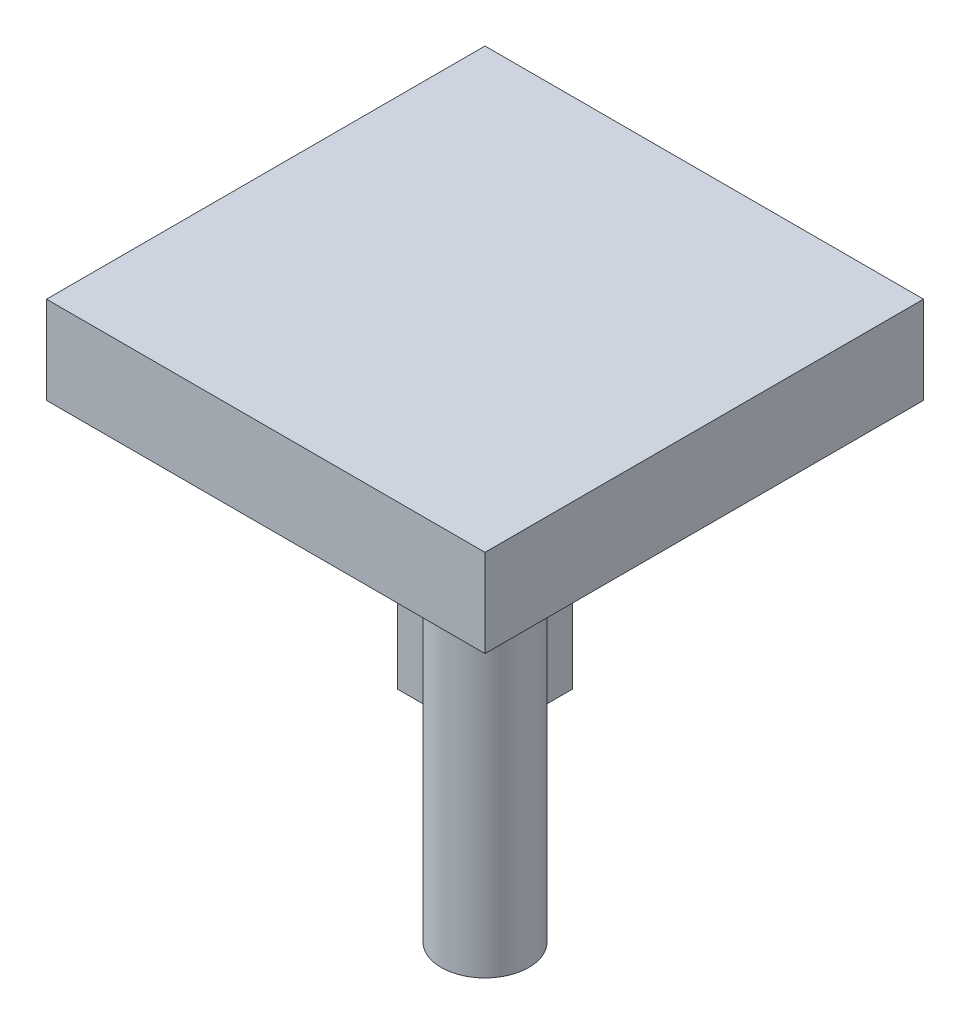
ISO-10303-21;
HEADER;
FILE_DESCRIPTION(('STEP AP214'),'2;1');
FILE_NAME('part.step','',(''),(''),'','','');
FILE_SCHEMA(('AUTOMOTIVE_DESIGN { 1 0 10303 214 1 1 1 1 }'));
ENDSEC;
DATA;
#1=APPLICATION_CONTEXT('core data for automotive mechanical design processes');
#2=APPLICATION_PROTOCOL_DEFINITION('international standard','automotive_design',2000,#1);
#3=PRODUCT_CONTEXT('',#1,'mechanical');
#4=PRODUCT('Part','Part','',(#3));
#5=PRODUCT_RELATED_PRODUCT_CATEGORY('part','',(#4));
#6=PRODUCT_DEFINITION_FORMATION('','',#4);
#7=PRODUCT_DEFINITION_CONTEXT('part definition',#1,'design');
#8=PRODUCT_DEFINITION('design','',#6,#7);
#9=PRODUCT_DEFINITION_SHAPE('','',#8);
#10=(LENGTH_UNIT() NAMED_UNIT(*) SI_UNIT(.MILLI.,.METRE.));
#11=(NAMED_UNIT(*) PLANE_ANGLE_UNIT() SI_UNIT($,.RADIAN.));
#12=(NAMED_UNIT(*) SI_UNIT($,.STERADIAN.) SOLID_ANGLE_UNIT());
#13=UNCERTAINTY_MEASURE_WITH_UNIT(LENGTH_MEASURE(1.E-05),#10,'distance_accuracy_value','');
#14=(GEOMETRIC_REPRESENTATION_CONTEXT(3) GLOBAL_UNCERTAINTY_ASSIGNED_CONTEXT((#13)) GLOBAL_UNIT_ASSIGNED_CONTEXT((#10,
#11,#12)) REPRESENTATION_CONTEXT('',''));
#15=CARTESIAN_POINT('',(0.,0.,0.));
#16=DIRECTION('',(0.,0.,1.));
#17=DIRECTION('',(1.,0.,0.));
#18=AXIS2_PLACEMENT_3D('',#15,#16,#17);
#19=CARTESIAN_POINT('',(-15.,-2.,-35.));
#20=DIRECTION('',(1.,0.,0.));
#21=DIRECTION('',(0.,0.,-1.));
#22=AXIS2_PLACEMENT_3D('',#19,#20,#21);
#23=PLANE('',#22);
#24=DIRECTION('',(0.,0.,1.));
#25=VECTOR('',#24,1.);
#26=CARTESIAN_POINT('',(-15.,-82.,-35.));
#27=LINE('',#26,#25);
#28=CARTESIAN_POINT('',(-15.,-82.,-35.));
#29=VERTEX_POINT('',#28);
#30=CARTESIAN_POINT('',(-15.,-82.,-15.));
#31=VERTEX_POINT('',#30);
#32=EDGE_CURVE('E70',#29,#31,#27,.T.);
#33=ORIENTED_EDGE('',*,*,#32,.F.);
#34=DIRECTION('',(0.,-1.,0.));
#35=VECTOR('',#34,1.);
#36=CARTESIAN_POINT('',(-15.,-2.,-35.));
#37=LINE('',#36,#35);
#38=CARTESIAN_POINT('',(-15.,-2.,-35.));
#39=VERTEX_POINT('',#38);
#40=EDGE_CURVE('E78',#39,#29,#37,.T.);
#41=ORIENTED_EDGE('',*,*,#40,.F.);
#42=DIRECTION('',(0.,0.,1.));
#43=VECTOR('',#42,1.);
#44=CARTESIAN_POINT('',(-15.,-2.,-35.));
#45=LINE('',#44,#43);
#46=CARTESIAN_POINT('',(-15.,-2.,-15.));
#47=VERTEX_POINT('',#46);
#48=EDGE_CURVE('E13',#39,#47,#45,.T.);
#49=ORIENTED_EDGE('',*,*,#48,.T.);
#50=DIRECTION('',(0.,-1.,0.));
#51=VECTOR('',#50,1.);
#52=CARTESIAN_POINT('',(-15.,-2.,-15.));
#53=LINE('',#52,#51);
#54=EDGE_CURVE('E107',#47,#31,#53,.T.);
#55=ORIENTED_EDGE('',*,*,#54,.T.);
#56=EDGE_LOOP('',(#33,#41,#49,#55));
#57=FACE_BOUND('',#56,.T.);
#58=ADVANCED_FACE('F62',(#57),#23,.T.);
#59=CARTESIAN_POINT('',(-35.,-2.,-15.));
#60=DIRECTION('',(0.,0.,1.));
#61=DIRECTION('',(1.,0.,0.));
#62=AXIS2_PLACEMENT_3D('',#59,#60,#61);
#63=PLANE('',#62);
#64=DIRECTION('',(-1.,0.,0.));
#65=VECTOR('',#64,1.);
#66=CARTESIAN_POINT('',(-35.,-82.,-15.));
#67=LINE('',#66,#65);
#68=CARTESIAN_POINT('',(-35.,-82.,-15.));
#69=VERTEX_POINT('',#68);
#70=EDGE_CURVE('E112',#31,#69,#67,.T.);
#71=ORIENTED_EDGE('',*,*,#70,.F.);
#72=ORIENTED_EDGE('',*,*,#54,.F.);
#73=DIRECTION('',(-1.,0.,0.));
#74=VECTOR('',#73,1.);
#75=CARTESIAN_POINT('',(-35.,-2.,-15.));
#76=LINE('',#75,#74);
#77=CARTESIAN_POINT('',(-35.,-2.,-15.));
#78=VERTEX_POINT('',#77);
#79=EDGE_CURVE('E110',#47,#78,#76,.T.);
#80=ORIENTED_EDGE('',*,*,#79,.T.);
#81=DIRECTION('',(0.,-1.,0.));
#82=VECTOR('',#81,1.);
#83=CARTESIAN_POINT('',(-35.,-2.,-15.));
#84=LINE('',#83,#82);
#85=EDGE_CURVE('E64',#78,#69,#84,.T.);
#86=ORIENTED_EDGE('',*,*,#85,.T.);
#87=EDGE_LOOP('',(#71,#72,#80,#86));
#88=FACE_BOUND('',#87,.T.);
#89=ADVANCED_FACE('F109',(#88),#63,.T.);
#90=CARTESIAN_POINT('',(-35.,-2.,-35.));
#91=DIRECTION('',(-1.,0.,0.));
#92=DIRECTION('',(0.,0.,1.));
#93=AXIS2_PLACEMENT_3D('',#90,#91,#92);
#94=PLANE('',#93);
#95=DIRECTION('',(0.,0.,-1.));
#96=VECTOR('',#95,1.);
#97=CARTESIAN_POINT('',(-35.,-82.,-35.));
#98=LINE('',#97,#96);
#99=CARTESIAN_POINT('',(-35.,-82.,-35.));
#100=VERTEX_POINT('',#99);
#101=EDGE_CURVE('E133',#69,#100,#98,.T.);
#102=ORIENTED_EDGE('',*,*,#101,.F.);
#103=ORIENTED_EDGE('',*,*,#85,.F.);
#104=DIRECTION('',(0.,0.,-1.));
#105=VECTOR('',#104,1.);
#106=CARTESIAN_POINT('',(-35.,-2.,-35.));
#107=LINE('',#106,#105);
#108=CARTESIAN_POINT('',(-35.,-2.,-35.));
#109=VERTEX_POINT('',#108);
#110=EDGE_CURVE('E138',#78,#109,#107,.T.);
#111=ORIENTED_EDGE('',*,*,#110,.T.);
#112=DIRECTION('',(0.,-1.,0.));
#113=VECTOR('',#112,1.);
#114=CARTESIAN_POINT('',(-35.,-2.,-35.));
#115=LINE('',#114,#113);
#116=EDGE_CURVE('E95',#109,#100,#115,.T.);
#117=ORIENTED_EDGE('',*,*,#116,.T.);
#118=EDGE_LOOP('',(#102,#103,#111,#117));
#119=FACE_BOUND('',#118,.T.);
#120=ADVANCED_FACE('F120',(#119),#94,.T.);
#121=CARTESIAN_POINT('',(-35.,-2.,-35.));
#122=DIRECTION('',(0.,0.,-1.));
#123=DIRECTION('',(-1.,0.,0.));
#124=AXIS2_PLACEMENT_3D('',#121,#122,#123);
#125=PLANE('',#124);
#126=DIRECTION('',(1.,0.,0.));
#127=VECTOR('',#126,1.);
#128=CARTESIAN_POINT('',(-35.,-82.,-35.));
#129=LINE('',#128,#127);
#130=EDGE_CURVE('E128',#100,#29,#129,.T.);
#131=ORIENTED_EDGE('',*,*,#130,.F.);
#132=ORIENTED_EDGE('',*,*,#116,.F.);
#133=DIRECTION('',(1.,0.,0.));
#134=VECTOR('',#133,1.);
#135=CARTESIAN_POINT('',(-35.,-2.,-35.));
#136=LINE('',#135,#134);
#137=EDGE_CURVE('E139',#109,#39,#136,.T.);
#138=ORIENTED_EDGE('',*,*,#137,.T.);
#139=ORIENTED_EDGE('',*,*,#40,.T.);
#140=EDGE_LOOP('',(#131,#132,#138,#139));
#141=FACE_BOUND('',#140,.T.);
#142=ADVANCED_FACE('F123',(#141),#125,.T.);
#143=OPEN_SHELL('',(#58,#89,#120,#142));
#144=SHELL_BASED_SURFACE_MODEL('B2',(#143));
#145=CARTESIAN_POINT('',(25.,-2.,25.));
#146=DIRECTION('',(0.,-1.,0.));
#147=DIRECTION('',(0.,0.,-1.));
#148=AXIS2_PLACEMENT_3D('',#145,#146,#147);
#149=CYLINDRICAL_SURFACE('',#148,10.);
#150=CARTESIAN_POINT('',(25.,-2.,25.));
#151=DIRECTION('',(0.,-1.,0.));
#152=DIRECTION('',(0.,0.,-1.));
#153=AXIS2_PLACEMENT_3D('',#150,#151,#152);
#154=CIRCLE('',#153,10.);
#155=CARTESIAN_POINT('',(25.,-2.,15.));
#156=VERTEX_POINT('',#155);
#157=EDGE_CURVE('E212',#156,#156,#154,.T.);
#158=ORIENTED_EDGE('',*,*,#157,.T.);
#159=EDGE_LOOP('',(#158));
#160=FACE_BOUND('',#159,.T.);
#161=CARTESIAN_POINT('',(25.,-82.,25.));
#162=DIRECTION('',(0.,-1.,0.));
#163=DIRECTION('',(0.,0.,-1.));
#164=AXIS2_PLACEMENT_3D('',#161,#162,#163);
#165=CIRCLE('',#164,10.);
#166=CARTESIAN_POINT('',(25.,-82.,15.));
#167=VERTEX_POINT('',#166);
#168=EDGE_CURVE('E61',#167,#167,#165,.T.);
#169=ORIENTED_EDGE('',*,*,#168,.F.);
#170=EDGE_LOOP('',(#169));
#171=FACE_BOUND('',#170,.T.);
#172=ADVANCED_FACE('F207',(#160,#171),#149,.T.);
#173=OPEN_SHELL('',(#172));
#174=SHELL_BASED_SURFACE_MODEL('B7',(#173));
#175=CARTESIAN_POINT('',(-50.,20.,-50.));
#176=DIRECTION('',(1.,0.,0.));
#177=DIRECTION('',(0.,0.,-1.));
#178=AXIS2_PLACEMENT_3D('',#175,#176,#177);
#179=PLANE('',#178);
#180=DIRECTION('',(0.,0.,1.));
#181=VECTOR('',#180,1.);
#182=CARTESIAN_POINT('',(-50.,0.,-50.));
#183=LINE('',#182,#181);
#184=CARTESIAN_POINT('',(-50.,0.,-50.));
#185=VERTEX_POINT('',#184);
#186=CARTESIAN_POINT('',(-50.,0.,50.));
#187=VERTEX_POINT('',#186);
#188=EDGE_CURVE('E334',#185,#187,#183,.T.);
#189=ORIENTED_EDGE('',*,*,#188,.T.);
#190=DIRECTION('',(0.,-1.,0.));
#191=VECTOR('',#190,1.);
#192=CARTESIAN_POINT('',(-50.,20.,50.));
#193=LINE('',#192,#191);
#194=CARTESIAN_POINT('',(-50.,20.,50.));
#195=VERTEX_POINT('',#194);
#196=EDGE_CURVE('E205',#195,#187,#193,.T.);
#197=ORIENTED_EDGE('',*,*,#196,.F.);
#198=DIRECTION('',(0.,0.,1.));
#199=VECTOR('',#198,1.);
#200=CARTESIAN_POINT('',(-50.,20.,-50.));
#201=LINE('',#200,#199);
#202=CARTESIAN_POINT('',(-50.,20.,-50.));
#203=VERTEX_POINT('',#202);
#204=EDGE_CURVE('E289',#203,#195,#201,.T.);
#205=ORIENTED_EDGE('',*,*,#204,.F.);
#206=DIRECTION('',(0.,-1.,0.));
#207=VECTOR('',#206,1.);
#208=CARTESIAN_POINT('',(-50.,20.,-50.));
#209=LINE('',#208,#207);
#210=EDGE_CURVE('E301',#203,#185,#209,.T.);
#211=ORIENTED_EDGE('',*,*,#210,.T.);
#212=EDGE_LOOP('',(#189,#197,#205,#211));
#213=FACE_BOUND('',#212,.T.);
#214=ADVANCED_FACE('F236',(#213),#179,.F.);
#215=CARTESIAN_POINT('',(50.,20.,50.));
#216=DIRECTION('',(0.,0.,-1.));
#217=DIRECTION('',(-1.,0.,0.));
#218=AXIS2_PLACEMENT_3D('',#215,#216,#217);
#219=PLANE('',#218);
#220=DIRECTION('',(1.,0.,0.));
#221=VECTOR('',#220,1.);
#222=CARTESIAN_POINT('',(50.,0.,50.));
#223=LINE('',#222,#221);
#224=CARTESIAN_POINT('',(50.,0.,50.));
#225=VERTEX_POINT('',#224);
#226=EDGE_CURVE('E294',#187,#225,#223,.T.);
#227=ORIENTED_EDGE('',*,*,#226,.T.);
#228=DIRECTION('',(0.,-1.,0.));
#229=VECTOR('',#228,1.);
#230=CARTESIAN_POINT('',(50.,20.,50.));
#231=LINE('',#230,#229);
#232=CARTESIAN_POINT('',(50.,20.,50.));
#233=VERTEX_POINT('',#232);
#234=EDGE_CURVE('E246',#233,#225,#231,.T.);
#235=ORIENTED_EDGE('',*,*,#234,.F.);
#236=DIRECTION('',(1.,0.,0.));
#237=VECTOR('',#236,1.);
#238=CARTESIAN_POINT('',(50.,20.,50.));
#239=LINE('',#238,#237);
#240=EDGE_CURVE('E284',#195,#233,#239,.T.);
#241=ORIENTED_EDGE('',*,*,#240,.F.);
#242=ORIENTED_EDGE('',*,*,#196,.T.);
#243=EDGE_LOOP('',(#227,#235,#241,#242));
#244=FACE_BOUND('',#243,.T.);
#245=ADVANCED_FACE('F293',(#244),#219,.F.);
#246=CARTESIAN_POINT('',(50.,20.,-50.));
#247=DIRECTION('',(-1.,0.,0.));
#248=DIRECTION('',(0.,0.,1.));
#249=AXIS2_PLACEMENT_3D('',#246,#247,#248);
#250=PLANE('',#249);
#251=DIRECTION('',(0.,0.,-1.));
#252=VECTOR('',#251,1.);
#253=CARTESIAN_POINT('',(50.,0.,-50.));
#254=LINE('',#253,#252);
#255=CARTESIAN_POINT('',(50.,0.,-50.));
#256=VERTEX_POINT('',#255);
#257=EDGE_CURVE('E271',#225,#256,#254,.T.);
#258=ORIENTED_EDGE('',*,*,#257,.T.);
#259=DIRECTION('',(0.,-1.,0.));
#260=VECTOR('',#259,1.);
#261=CARTESIAN_POINT('',(50.,20.,-50.));
#262=LINE('',#261,#260);
#263=CARTESIAN_POINT('',(50.,20.,-50.));
#264=VERTEX_POINT('',#263);
#265=EDGE_CURVE('E296',#264,#256,#262,.T.);
#266=ORIENTED_EDGE('',*,*,#265,.F.);
#267=DIRECTION('',(0.,0.,-1.));
#268=VECTOR('',#267,1.);
#269=CARTESIAN_POINT('',(50.,20.,-50.));
#270=LINE('',#269,#268);
#271=EDGE_CURVE('E287',#233,#264,#270,.T.);
#272=ORIENTED_EDGE('',*,*,#271,.F.);
#273=ORIENTED_EDGE('',*,*,#234,.T.);
#274=EDGE_LOOP('',(#258,#266,#272,#273));
#275=FACE_BOUND('',#274,.T.);
#276=ADVANCED_FACE('F297',(#275),#250,.F.);
#277=CARTESIAN_POINT('',(50.,20.,-50.));
#278=DIRECTION('',(0.,0.,1.));
#279=DIRECTION('',(1.,0.,0.));
#280=AXIS2_PLACEMENT_3D('',#277,#278,#279);
#281=PLANE('',#280);
#282=DIRECTION('',(-1.,0.,0.));
#283=VECTOR('',#282,1.);
#284=CARTESIAN_POINT('',(50.,0.,-50.));
#285=LINE('',#284,#283);
#286=EDGE_CURVE('E277',#256,#185,#285,.T.);
#287=ORIENTED_EDGE('',*,*,#286,.T.);
#288=ORIENTED_EDGE('',*,*,#210,.F.);
#289=DIRECTION('',(-1.,0.,0.));
#290=VECTOR('',#289,1.);
#291=CARTESIAN_POINT('',(50.,20.,-50.));
#292=LINE('',#291,#290);
#293=EDGE_CURVE('E254',#264,#203,#292,.T.);
#294=ORIENTED_EDGE('',*,*,#293,.F.);
#295=ORIENTED_EDGE('',*,*,#265,.T.);
#296=EDGE_LOOP('',(#287,#288,#294,#295));
#297=FACE_BOUND('',#296,.T.);
#298=ADVANCED_FACE('F346',(#297),#281,.F.);
#299=CARTESIAN_POINT('',(0.,20.,0.));
#300=DIRECTION('',(0.,-1.,0.));
#301=DIRECTION('',(0.,0.,-1.));
#302=AXIS2_PLACEMENT_3D('',#299,#300,#301);
#303=PLANE('',#302);
#304=ORIENTED_EDGE('',*,*,#204,.T.);
#305=ORIENTED_EDGE('',*,*,#240,.T.);
#306=ORIENTED_EDGE('',*,*,#271,.T.);
#307=ORIENTED_EDGE('',*,*,#293,.T.);
#308=EDGE_LOOP('',(#304,#305,#306,#307));
#309=FACE_BOUND('',#308,.T.);
#310=ADVANCED_FACE('F285',(#309),#303,.F.);
#311=CARTESIAN_POINT('',(0.,0.,0.));
#312=DIRECTION('',(0.,-1.,0.));
#313=DIRECTION('',(0.,0.,-1.));
#314=AXIS2_PLACEMENT_3D('',#311,#312,#313);
#315=PLANE('',#314);
#316=ORIENTED_EDGE('',*,*,#188,.F.);
#317=ORIENTED_EDGE('',*,*,#286,.F.);
#318=ORIENTED_EDGE('',*,*,#257,.F.);
#319=ORIENTED_EDGE('',*,*,#226,.F.);
#320=EDGE_LOOP('',(#316,#317,#318,#319));
#321=FACE_BOUND('',#320,.T.);
#322=ADVANCED_FACE('F341',(#321),#315,.T.);
#323=CLOSED_SHELL('',(#214,#245,#276,#298,#310,#322));
#324=MANIFOLD_SOLID_BREP('B56',#323);
#325=ADVANCED_BREP_SHAPE_REPRESENTATION('',(#18,#324),#14);
#326=MANIFOLD_SURFACE_SHAPE_REPRESENTATION('',(#18,#144,#174),#14);
#327=SHAPE_REPRESENTATION('',(#18),#14);
#328=SHAPE_DEFINITION_REPRESENTATION(#9,#327);
#329=SHAPE_REPRESENTATION_RELATIONSHIP('','',#327,#325);
#330=SHAPE_REPRESENTATION_RELATIONSHIP('','',#327,#326);
ENDSEC;
END-ISO-10303-21;
